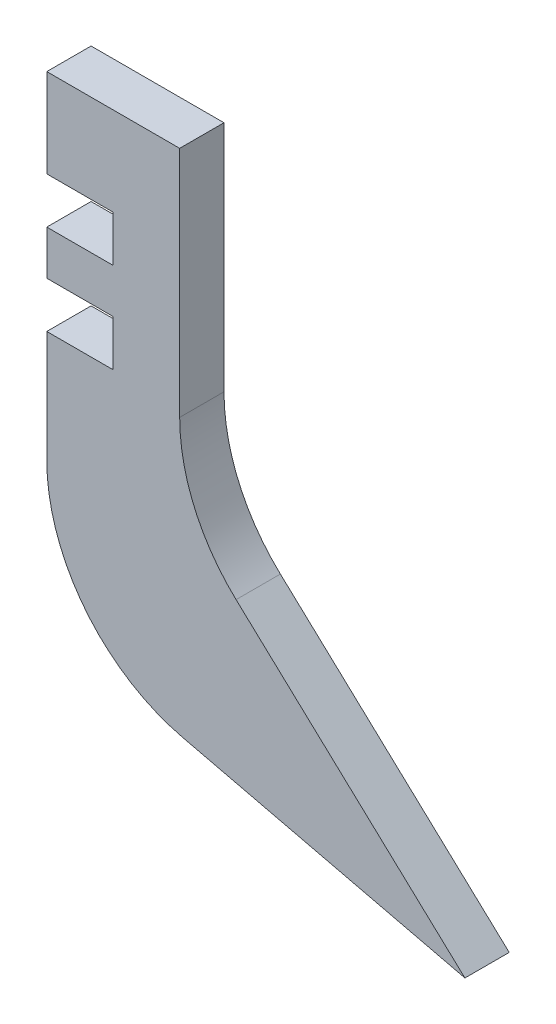
ISO-10303-21;
HEADER;
FILE_DESCRIPTION(('STEP AP214'),'2;1');
FILE_NAME('part.step','',(''),(''),'','','');
FILE_SCHEMA(('AUTOMOTIVE_DESIGN { 1 0 10303 214 1 1 1 1 }'));
ENDSEC;
DATA;
#1=APPLICATION_CONTEXT('core data for automotive mechanical design processes');
#2=APPLICATION_PROTOCOL_DEFINITION('international standard','automotive_design',2000,#1);
#3=PRODUCT_CONTEXT('',#1,'mechanical');
#4=PRODUCT('Part','Part','',(#3));
#5=PRODUCT_RELATED_PRODUCT_CATEGORY('part','',(#4));
#6=PRODUCT_DEFINITION_FORMATION('','',#4);
#7=PRODUCT_DEFINITION_CONTEXT('part definition',#1,'design');
#8=PRODUCT_DEFINITION('design','',#6,#7);
#9=PRODUCT_DEFINITION_SHAPE('','',#8);
#10=(LENGTH_UNIT() NAMED_UNIT(*) SI_UNIT(.MILLI.,.METRE.));
#11=(NAMED_UNIT(*) PLANE_ANGLE_UNIT() SI_UNIT($,.RADIAN.));
#12=(NAMED_UNIT(*) SI_UNIT($,.STERADIAN.) SOLID_ANGLE_UNIT());
#13=UNCERTAINTY_MEASURE_WITH_UNIT(LENGTH_MEASURE(1.E-05),#10,'distance_accuracy_value','');
#14=(GEOMETRIC_REPRESENTATION_CONTEXT(3) GLOBAL_UNCERTAINTY_ASSIGNED_CONTEXT((#13)) GLOBAL_UNIT_ASSIGNED_CONTEXT((#10,
#11,#12)) REPRESENTATION_CONTEXT('',''));
#15=CARTESIAN_POINT('',(0.,0.,0.));
#16=DIRECTION('',(0.,0.,1.));
#17=DIRECTION('',(1.,0.,0.));
#18=AXIS2_PLACEMENT_3D('',#15,#16,#17);
#19=CARTESIAN_POINT('',(0.,53.7638830171852,5.));
#20=DIRECTION('',(1.,0.,0.));
#21=DIRECTION('',(0.,0.,-1.));
#22=AXIS2_PLACEMENT_3D('',#19,#20,#21);
#23=PLANE('',#22);
#24=DIRECTION('',(0.,0.,-1.));
#25=VECTOR('',#24,1.);
#26=CARTESIAN_POINT('',(0.,28.3638830171852,5.));
#27=LINE('',#26,#25);
#28=CARTESIAN_POINT('',(0.,28.3638830171852,5.));
#29=VERTEX_POINT('',#28);
#30=CARTESIAN_POINT('',(0.,28.3638830171852,0.));
#31=VERTEX_POINT('',#30);
#32=EDGE_CURVE('E140',#29,#31,#27,.T.);
#33=ORIENTED_EDGE('',*,*,#32,.T.);
#34=DIRECTION('',(0.,-1.,0.));
#35=VECTOR('',#34,1.);
#36=CARTESIAN_POINT('',(0.,53.7638830171852,0.));
#37=LINE('',#36,#35);
#38=CARTESIAN_POINT('',(0.,15.7972957955316,0.));
#39=VERTEX_POINT('',#38);
#40=EDGE_CURVE('E189',#31,#39,#37,.T.);
#41=ORIENTED_EDGE('',*,*,#40,.T.);
#42=DIRECTION('',(0.,0.,-1.));
#43=VECTOR('',#42,1.);
#44=CARTESIAN_POINT('',(0.,15.7972957955316,5.));
#45=LINE('',#44,#43);
#46=CARTESIAN_POINT('',(0.,15.7972957955316,5.));
#47=VERTEX_POINT('',#46);
#48=EDGE_CURVE('E163',#39,#47,#45,.F.);
#49=ORIENTED_EDGE('',*,*,#48,.T.);
#50=DIRECTION('',(0.,-1.,0.));
#51=VECTOR('',#50,1.);
#52=CARTESIAN_POINT('',(0.,53.7638830171852,5.));
#53=LINE('',#52,#51);
#54=EDGE_CURVE('E156',#29,#47,#53,.T.);
#55=ORIENTED_EDGE('',*,*,#54,.F.);
#56=EDGE_LOOP('',(#33,#41,#49,#55));
#57=FACE_BOUND('',#56,.T.);
#58=ADVANCED_FACE('F33',(#57),#23,.F.);
#59=DIRECTION('',(0.,0.,-1.));
#60=VECTOR('',#59,1.);
#61=CARTESIAN_POINT('',(0.,33.5638830171852,5.));
#62=LINE('',#61,#60);
#63=CARTESIAN_POINT('',(0.,33.5638830171852,5.));
#64=VERTEX_POINT('',#63);
#65=CARTESIAN_POINT('',(0.,33.5638830171852,0.));
#66=VERTEX_POINT('',#65);
#67=EDGE_CURVE('E48',#64,#66,#62,.T.);
#68=ORIENTED_EDGE('',*,*,#67,.F.);
#69=CARTESIAN_POINT('',(0.,38.5638830171852,5.));
#70=VERTEX_POINT('',#69);
#71=EDGE_CURVE('E165',#70,#64,#53,.T.);
#72=ORIENTED_EDGE('',*,*,#71,.F.);
#73=DIRECTION('',(0.,0.,-1.));
#74=VECTOR('',#73,1.);
#75=CARTESIAN_POINT('',(0.,38.5638830171852,5.));
#76=LINE('',#75,#74);
#77=CARTESIAN_POINT('',(0.,38.5638830171852,0.));
#78=VERTEX_POINT('',#77);
#79=EDGE_CURVE('E190',#70,#78,#76,.T.);
#80=ORIENTED_EDGE('',*,*,#79,.T.);
#81=EDGE_CURVE('E195',#78,#66,#37,.T.);
#82=ORIENTED_EDGE('',*,*,#81,.T.);
#83=EDGE_LOOP('',(#68,#72,#80,#82));
#84=FACE_BOUND('',#83,.T.);
#85=ADVANCED_FACE('F262',(#84),#23,.F.);
#86=CARTESIAN_POINT('',(0.,0.,5.));
#87=DIRECTION('',(0.,0.,-1.));
#88=DIRECTION('',(-1.,0.,0.));
#89=AXIS2_PLACEMENT_3D('',#86,#87,#88);
#90=PLANE('',#89);
#91=DIRECTION('',(1.,0.,0.));
#92=VECTOR('',#91,1.);
#93=CARTESIAN_POINT('',(0.,28.3638830171852,5.));
#94=LINE('',#93,#92);
#95=CARTESIAN_POINT('',(7.5,28.3638830171852,5.));
#96=VERTEX_POINT('',#95);
#97=EDGE_CURVE('E143',#29,#96,#94,.T.);
#98=ORIENTED_EDGE('',*,*,#97,.F.);
#99=ORIENTED_EDGE('',*,*,#54,.T.);
#100=CARTESIAN_POINT('',(20.,15.7972957955316,5.));
#101=DIRECTION('',(0.,0.,-1.));
#102=DIRECTION('',(-1.,0.,0.));
#103=AXIS2_PLACEMENT_3D('',#100,#101,#102);
#104=CIRCLE('',#103,20.);
#105=CARTESIAN_POINT('',(15.3677348725385,-3.65886312109178,5.));
#106=VERTEX_POINT('',#105);
#107=EDGE_CURVE('E216',#47,#106,#104,.F.);
#108=ORIENTED_EDGE('',*,*,#107,.T.);
#109=DIRECTION('',(0.972807945831169,-0.231613256373076,0.));
#110=VECTOR('',#109,1.);
#111=CARTESIAN_POINT('',(0.,0.,5.));
#112=LINE('',#111,#110);
#113=CARTESIAN_POINT('',(47.1932567778595,-11.2361169828148,5.));
#114=VERTEX_POINT('',#113);
#115=EDGE_CURVE('E175',#106,#114,#112,.T.);
#116=ORIENTED_EDGE('',*,*,#115,.T.);
#117=DIRECTION('',(-0.731588261023589,0.68174673914327,0.));
#118=VECTOR('',#117,1.);
#119=CARTESIAN_POINT('',(15.,18.7638830171852,5.));
#120=LINE('',#119,#118);
#121=CARTESIAN_POINT('',(21.3650652171346,12.8324558915716,5.));
#122=VERTEX_POINT('',#121);
#123=EDGE_CURVE('E177',#114,#122,#120,.T.);
#124=ORIENTED_EDGE('',*,*,#123,.T.);
#125=CARTESIAN_POINT('',(35.,27.4642211120434,5.));
#126=DIRECTION('',(0.,0.,-1.));
#127=DIRECTION('',(-1.,0.,0.));
#128=AXIS2_PLACEMENT_3D('',#125,#126,#127);
#129=CIRCLE('',#128,20.);
#130=CARTESIAN_POINT('',(15.,27.4642211120434,5.));
#131=VERTEX_POINT('',#130);
#132=EDGE_CURVE('E11',#122,#131,#129,.T.);
#133=ORIENTED_EDGE('',*,*,#132,.T.);
#134=DIRECTION('',(0.,1.,0.));
#135=VECTOR('',#134,1.);
#136=CARTESIAN_POINT('',(15.,53.7638830171852,5.));
#137=LINE('',#136,#135);
#138=CARTESIAN_POINT('',(15.,53.7638830171852,5.));
#139=VERTEX_POINT('',#138);
#140=EDGE_CURVE('E181',#131,#139,#137,.T.);
#141=ORIENTED_EDGE('',*,*,#140,.T.);
#142=DIRECTION('',(-1.,0.,0.));
#143=VECTOR('',#142,1.);
#144=CARTESIAN_POINT('',(0.,53.7638830171852,5.));
#145=LINE('',#144,#143);
#146=CARTESIAN_POINT('',(0.,53.7638830171852,5.));
#147=VERTEX_POINT('',#146);
#148=EDGE_CURVE('E166',#139,#147,#145,.T.);
#149=ORIENTED_EDGE('',*,*,#148,.T.);
#150=CARTESIAN_POINT('',(0.,43.7638830171852,5.));
#151=VERTEX_POINT('',#150);
#152=EDGE_CURVE('E168',#147,#151,#53,.T.);
#153=ORIENTED_EDGE('',*,*,#152,.T.);
#154=DIRECTION('',(-1.,0.,0.));
#155=VECTOR('',#154,1.);
#156=CARTESIAN_POINT('',(0.,43.7638830171852,5.));
#157=LINE('',#156,#155);
#158=CARTESIAN_POINT('',(7.5,43.7638830171852,5.));
#159=VERTEX_POINT('',#158);
#160=EDGE_CURVE('E246',#159,#151,#157,.T.);
#161=ORIENTED_EDGE('',*,*,#160,.F.);
#162=DIRECTION('',(0.,1.,0.));
#163=VECTOR('',#162,1.);
#164=CARTESIAN_POINT('',(7.5,43.7638830171852,5.));
#165=LINE('',#164,#163);
#166=CARTESIAN_POINT('',(7.5,38.5638830171852,5.));
#167=VERTEX_POINT('',#166);
#168=EDGE_CURVE('E250',#167,#159,#165,.T.);
#169=ORIENTED_EDGE('',*,*,#168,.F.);
#170=DIRECTION('',(1.,0.,0.));
#171=VECTOR('',#170,1.);
#172=CARTESIAN_POINT('',(0.,38.5638830171852,5.));
#173=LINE('',#172,#171);
#174=EDGE_CURVE('E341',#70,#167,#173,.T.);
#175=ORIENTED_EDGE('',*,*,#174,.F.);
#176=ORIENTED_EDGE('',*,*,#71,.T.);
#177=DIRECTION('',(-1.,0.,0.));
#178=VECTOR('',#177,1.);
#179=CARTESIAN_POINT('',(0.,33.5638830171852,5.));
#180=LINE('',#179,#178);
#181=CARTESIAN_POINT('',(7.5,33.5638830171852,5.));
#182=VERTEX_POINT('',#181);
#183=EDGE_CURVE('E338',#182,#64,#180,.T.);
#184=ORIENTED_EDGE('',*,*,#183,.F.);
#185=DIRECTION('',(0.,1.,0.));
#186=VECTOR('',#185,1.);
#187=CARTESIAN_POINT('',(7.5,33.5638830171852,5.));
#188=LINE('',#187,#186);
#189=EDGE_CURVE('E159',#96,#182,#188,.T.);
#190=ORIENTED_EDGE('',*,*,#189,.F.);
#191=EDGE_LOOP('',(#98,#99,#108,#116,#124,#133,#141,#149,#153,#161,#169,#175,#176,#184,#190));
#192=FACE_BOUND('',#191,.T.);
#193=ADVANCED_FACE('F155',(#192),#90,.F.);
#194=CARTESIAN_POINT('',(0.,0.,0.));
#195=DIRECTION('',(0.,0.,-1.));
#196=DIRECTION('',(-1.,0.,0.));
#197=AXIS2_PLACEMENT_3D('',#194,#195,#196);
#198=PLANE('',#197);
#199=ORIENTED_EDGE('',*,*,#40,.F.);
#200=DIRECTION('',(1.,0.,0.));
#201=VECTOR('',#200,1.);
#202=CARTESIAN_POINT('',(0.,28.3638830171852,0.));
#203=LINE('',#202,#201);
#204=CARTESIAN_POINT('',(7.5,28.3638830171852,0.));
#205=VERTEX_POINT('',#204);
#206=EDGE_CURVE('E146',#31,#205,#203,.T.);
#207=ORIENTED_EDGE('',*,*,#206,.T.);
#208=DIRECTION('',(0.,1.,0.));
#209=VECTOR('',#208,1.);
#210=CARTESIAN_POINT('',(7.5,33.5638830171852,0.));
#211=LINE('',#210,#209);
#212=CARTESIAN_POINT('',(7.5,33.5638830171852,0.));
#213=VERTEX_POINT('',#212);
#214=EDGE_CURVE('E330',#205,#213,#211,.T.);
#215=ORIENTED_EDGE('',*,*,#214,.T.);
#216=DIRECTION('',(-1.,0.,0.));
#217=VECTOR('',#216,1.);
#218=CARTESIAN_POINT('',(0.,33.5638830171852,0.));
#219=LINE('',#218,#217);
#220=EDGE_CURVE('E160',#213,#66,#219,.T.);
#221=ORIENTED_EDGE('',*,*,#220,.T.);
#222=ORIENTED_EDGE('',*,*,#81,.F.);
#223=DIRECTION('',(1.,0.,0.));
#224=VECTOR('',#223,1.);
#225=CARTESIAN_POINT('',(0.,38.5638830171852,0.));
#226=LINE('',#225,#224);
#227=CARTESIAN_POINT('',(7.5,38.5638830171852,0.));
#228=VERTEX_POINT('',#227);
#229=EDGE_CURVE('E150',#78,#228,#226,.T.);
#230=ORIENTED_EDGE('',*,*,#229,.T.);
#231=DIRECTION('',(0.,1.,0.));
#232=VECTOR('',#231,1.);
#233=CARTESIAN_POINT('',(7.5,43.7638830171852,0.));
#234=LINE('',#233,#232);
#235=CARTESIAN_POINT('',(7.5,43.7638830171852,0.));
#236=VERTEX_POINT('',#235);
#237=EDGE_CURVE('E344',#228,#236,#234,.T.);
#238=ORIENTED_EDGE('',*,*,#237,.T.);
#239=DIRECTION('',(-1.,0.,0.));
#240=VECTOR('',#239,1.);
#241=CARTESIAN_POINT('',(0.,43.7638830171852,0.));
#242=LINE('',#241,#240);
#243=CARTESIAN_POINT('',(0.,43.7638830171852,0.));
#244=VERTEX_POINT('',#243);
#245=EDGE_CURVE('E253',#236,#244,#242,.T.);
#246=ORIENTED_EDGE('',*,*,#245,.T.);
#247=CARTESIAN_POINT('',(0.,53.7638830171852,0.));
#248=VERTEX_POINT('',#247);
#249=EDGE_CURVE('E191',#248,#244,#37,.T.);
#250=ORIENTED_EDGE('',*,*,#249,.F.);
#251=DIRECTION('',(-1.,0.,0.));
#252=VECTOR('',#251,1.);
#253=CARTESIAN_POINT('',(0.,53.7638830171852,0.));
#254=LINE('',#253,#252);
#255=CARTESIAN_POINT('',(15.,53.7638830171852,0.));
#256=VERTEX_POINT('',#255);
#257=EDGE_CURVE('E186',#256,#248,#254,.T.);
#258=ORIENTED_EDGE('',*,*,#257,.F.);
#259=DIRECTION('',(0.,1.,0.));
#260=VECTOR('',#259,1.);
#261=CARTESIAN_POINT('',(15.,53.7638830171852,0.));
#262=LINE('',#261,#260);
#263=CARTESIAN_POINT('',(15.,27.4642211120434,0.));
#264=VERTEX_POINT('',#263);
#265=EDGE_CURVE('E171',#264,#256,#262,.T.);
#266=ORIENTED_EDGE('',*,*,#265,.F.);
#267=CARTESIAN_POINT('',(35.,27.4642211120434,0.));
#268=DIRECTION('',(0.,0.,-1.));
#269=DIRECTION('',(-1.,0.,0.));
#270=AXIS2_PLACEMENT_3D('',#267,#268,#269);
#271=CIRCLE('',#270,20.);
#272=CARTESIAN_POINT('',(21.3650652171346,12.8324558915716,0.));
#273=VERTEX_POINT('',#272);
#274=EDGE_CURVE('E41',#264,#273,#271,.F.);
#275=ORIENTED_EDGE('',*,*,#274,.T.);
#276=DIRECTION('',(-0.731588261023589,0.68174673914327,0.));
#277=VECTOR('',#276,1.);
#278=CARTESIAN_POINT('',(15.,18.7638830171852,0.));
#279=LINE('',#278,#277);
#280=CARTESIAN_POINT('',(47.1932567778595,-11.2361169828148,0.));
#281=VERTEX_POINT('',#280);
#282=EDGE_CURVE('E197',#281,#273,#279,.T.);
#283=ORIENTED_EDGE('',*,*,#282,.F.);
#284=DIRECTION('',(0.972807945831169,-0.231613256373076,0.));
#285=VECTOR('',#284,1.);
#286=CARTESIAN_POINT('',(0.,0.,0.));
#287=LINE('',#286,#285);
#288=CARTESIAN_POINT('',(15.3677348725385,-3.65886312109178,0.));
#289=VERTEX_POINT('',#288);
#290=EDGE_CURVE('E194',#289,#281,#287,.T.);
#291=ORIENTED_EDGE('',*,*,#290,.F.);
#292=CARTESIAN_POINT('',(20.,15.7972957955316,0.));
#293=DIRECTION('',(0.,0.,-1.));
#294=DIRECTION('',(-1.,0.,0.));
#295=AXIS2_PLACEMENT_3D('',#292,#293,#294);
#296=CIRCLE('',#295,20.);
#297=EDGE_CURVE('E212',#289,#39,#296,.T.);
#298=ORIENTED_EDGE('',*,*,#297,.T.);
#299=EDGE_LOOP('',(#199,#207,#215,#221,#222,#230,#238,#246,#250,#258,#266,#275,#283,#291,#298));
#300=FACE_BOUND('',#299,.T.);
#301=ADVANCED_FACE('F225',(#300),#198,.T.);
#302=DIRECTION('',(0.,0.,-1.));
#303=VECTOR('',#302,1.);
#304=CARTESIAN_POINT('',(0.,43.7638830171852,5.));
#305=LINE('',#304,#303);
#306=EDGE_CURVE('E56',#151,#244,#305,.T.);
#307=ORIENTED_EDGE('',*,*,#306,.F.);
#308=ORIENTED_EDGE('',*,*,#152,.F.);
#309=DIRECTION('',(0.,0.,-1.));
#310=VECTOR('',#309,1.);
#311=CARTESIAN_POINT('',(0.,53.7638830171852,5.));
#312=LINE('',#311,#310);
#313=EDGE_CURVE('E206',#147,#248,#312,.T.);
#314=ORIENTED_EDGE('',*,*,#313,.T.);
#315=ORIENTED_EDGE('',*,*,#249,.T.);
#316=EDGE_LOOP('',(#307,#308,#314,#315));
#317=FACE_BOUND('',#316,.T.);
#318=ADVANCED_FACE('F244',(#317),#23,.F.);
#319=CARTESIAN_POINT('',(0.,53.7638830171852,5.));
#320=DIRECTION('',(0.,-1.,0.));
#321=DIRECTION('',(0.,0.,-1.));
#322=AXIS2_PLACEMENT_3D('',#319,#320,#321);
#323=PLANE('',#322);
#324=ORIENTED_EDGE('',*,*,#257,.T.);
#325=ORIENTED_EDGE('',*,*,#313,.F.);
#326=ORIENTED_EDGE('',*,*,#148,.F.);
#327=DIRECTION('',(0.,0.,-1.));
#328=VECTOR('',#327,1.);
#329=CARTESIAN_POINT('',(15.,53.7638830171852,5.));
#330=LINE('',#329,#328);
#331=EDGE_CURVE('E185',#139,#256,#330,.T.);
#332=ORIENTED_EDGE('',*,*,#331,.T.);
#333=EDGE_LOOP('',(#324,#325,#326,#332));
#334=FACE_BOUND('',#333,.T.);
#335=ADVANCED_FACE('F242',(#334),#323,.F.);
#336=CARTESIAN_POINT('',(0.,0.,5.));
#337=DIRECTION('',(0.231613256373076,0.972807945831169,0.));
#338=DIRECTION('',(-0.97280794583117,0.231613256373076,0.));
#339=AXIS2_PLACEMENT_3D('',#336,#337,#338);
#340=PLANE('',#339);
#341=ORIENTED_EDGE('',*,*,#115,.F.);
#342=DIRECTION('',(0.,0.,-1.));
#343=VECTOR('',#342,1.);
#344=CARTESIAN_POINT('',(15.3677348725385,-3.65886312109178,5.));
#345=LINE('',#344,#343);
#346=EDGE_CURVE('E209',#106,#289,#345,.T.);
#347=ORIENTED_EDGE('',*,*,#346,.T.);
#348=ORIENTED_EDGE('',*,*,#290,.T.);
#349=DIRECTION('',(0.,0.,-1.));
#350=VECTOR('',#349,1.);
#351=CARTESIAN_POINT('',(47.1932567778595,-11.2361169828148,5.));
#352=LINE('',#351,#350);
#353=EDGE_CURVE('E203',#114,#281,#352,.T.);
#354=ORIENTED_EDGE('',*,*,#353,.F.);
#355=EDGE_LOOP('',(#341,#347,#348,#354));
#356=FACE_BOUND('',#355,.T.);
#357=ADVANCED_FACE('F272',(#356),#340,.F.);
#358=CARTESIAN_POINT('',(15.,18.7638830171852,5.));
#359=DIRECTION('',(-0.68174673914327,-0.731588261023589,0.));
#360=DIRECTION('',(0.731588261023589,-0.68174673914327,0.));
#361=AXIS2_PLACEMENT_3D('',#358,#359,#360);
#362=PLANE('',#361);
#363=ORIENTED_EDGE('',*,*,#282,.T.);
#364=DIRECTION('',(0.,0.,-1.));
#365=VECTOR('',#364,1.);
#366=CARTESIAN_POINT('',(21.3650652171346,12.8324558915716,5.));
#367=LINE('',#366,#365);
#368=EDGE_CURVE('E221',#273,#122,#367,.F.);
#369=ORIENTED_EDGE('',*,*,#368,.T.);
#370=ORIENTED_EDGE('',*,*,#123,.F.);
#371=ORIENTED_EDGE('',*,*,#353,.T.);
#372=EDGE_LOOP('',(#363,#369,#370,#371));
#373=FACE_BOUND('',#372,.T.);
#374=ADVANCED_FACE('F232',(#373),#362,.F.);
#375=CARTESIAN_POINT('',(15.,53.7638830171852,5.));
#376=DIRECTION('',(-1.,0.,0.));
#377=DIRECTION('',(0.,0.,1.));
#378=AXIS2_PLACEMENT_3D('',#375,#376,#377);
#379=PLANE('',#378);
#380=ORIENTED_EDGE('',*,*,#140,.F.);
#381=DIRECTION('',(0.,0.,-1.));
#382=VECTOR('',#381,1.);
#383=CARTESIAN_POINT('',(15.,27.4642211120434,0.));
#384=LINE('',#383,#382);
#385=EDGE_CURVE('E218',#131,#264,#384,.T.);
#386=ORIENTED_EDGE('',*,*,#385,.T.);
#387=ORIENTED_EDGE('',*,*,#265,.T.);
#388=ORIENTED_EDGE('',*,*,#331,.F.);
#389=EDGE_LOOP('',(#380,#386,#387,#388));
#390=FACE_BOUND('',#389,.T.);
#391=ADVANCED_FACE('F238',(#390),#379,.F.);
#392=CARTESIAN_POINT('',(20.,15.7972957955316,5.));
#393=DIRECTION('',(0.,0.,-1.));
#394=DIRECTION('',(-1.,0.,0.));
#395=AXIS2_PLACEMENT_3D('',#392,#393,#394);
#396=CYLINDRICAL_SURFACE('',#395,20.);
#397=ORIENTED_EDGE('',*,*,#107,.F.);
#398=ORIENTED_EDGE('',*,*,#48,.F.);
#399=ORIENTED_EDGE('',*,*,#297,.F.);
#400=ORIENTED_EDGE('',*,*,#346,.F.);
#401=EDGE_LOOP('',(#397,#398,#399,#400));
#402=FACE_BOUND('',#401,.T.);
#403=ADVANCED_FACE('F270',(#402),#396,.T.);
#404=CARTESIAN_POINT('',(35.,27.4642211120434,5.));
#405=DIRECTION('',(0.,0.,1.));
#406=DIRECTION('',(1.,0.,0.));
#407=AXIS2_PLACEMENT_3D('',#404,#405,#406);
#408=CYLINDRICAL_SURFACE('',#407,20.);
#409=ORIENTED_EDGE('',*,*,#132,.F.);
#410=ORIENTED_EDGE('',*,*,#368,.F.);
#411=ORIENTED_EDGE('',*,*,#274,.F.);
#412=ORIENTED_EDGE('',*,*,#385,.F.);
#413=EDGE_LOOP('',(#409,#410,#411,#412));
#414=FACE_BOUND('',#413,.T.);
#415=ADVANCED_FACE('F35',(#414),#408,.F.);
#416=CARTESIAN_POINT('',(0.,38.5638830171852,5.));
#417=DIRECTION('',(0.,1.,0.));
#418=DIRECTION('',(0.,0.,1.));
#419=AXIS2_PLACEMENT_3D('',#416,#417,#418);
#420=PLANE('',#419);
#421=ORIENTED_EDGE('',*,*,#229,.F.);
#422=ORIENTED_EDGE('',*,*,#79,.F.);
#423=ORIENTED_EDGE('',*,*,#174,.T.);
#424=DIRECTION('',(0.,0.,-1.));
#425=VECTOR('',#424,1.);
#426=CARTESIAN_POINT('',(7.5,38.5638830171852,5.));
#427=LINE('',#426,#425);
#428=EDGE_CURVE('E248',#167,#228,#427,.T.);
#429=ORIENTED_EDGE('',*,*,#428,.T.);
#430=EDGE_LOOP('',(#421,#422,#423,#429));
#431=FACE_BOUND('',#430,.T.);
#432=ADVANCED_FACE('F304',(#431),#420,.T.);
#433=CARTESIAN_POINT('',(7.5,43.7638830171852,5.));
#434=DIRECTION('',(-1.,0.,0.));
#435=DIRECTION('',(0.,-1.,0.));
#436=AXIS2_PLACEMENT_3D('',#433,#434,#435);
#437=PLANE('',#436);
#438=ORIENTED_EDGE('',*,*,#237,.F.);
#439=ORIENTED_EDGE('',*,*,#428,.F.);
#440=ORIENTED_EDGE('',*,*,#168,.T.);
#441=DIRECTION('',(0.,0.,-1.));
#442=VECTOR('',#441,1.);
#443=CARTESIAN_POINT('',(7.5,43.7638830171852,5.));
#444=LINE('',#443,#442);
#445=EDGE_CURVE('E245',#159,#236,#444,.T.);
#446=ORIENTED_EDGE('',*,*,#445,.T.);
#447=EDGE_LOOP('',(#438,#439,#440,#446));
#448=FACE_BOUND('',#447,.T.);
#449=ADVANCED_FACE('F308',(#448),#437,.T.);
#450=CARTESIAN_POINT('',(0.,43.7638830171852,5.));
#451=DIRECTION('',(0.,-1.,0.));
#452=DIRECTION('',(0.,0.,-1.));
#453=AXIS2_PLACEMENT_3D('',#450,#451,#452);
#454=PLANE('',#453);
#455=ORIENTED_EDGE('',*,*,#245,.F.);
#456=ORIENTED_EDGE('',*,*,#445,.F.);
#457=ORIENTED_EDGE('',*,*,#160,.T.);
#458=ORIENTED_EDGE('',*,*,#306,.T.);
#459=EDGE_LOOP('',(#455,#456,#457,#458));
#460=FACE_BOUND('',#459,.T.);
#461=ADVANCED_FACE('F312',(#460),#454,.T.);
#462=CARTESIAN_POINT('',(0.,28.3638830171852,5.));
#463=DIRECTION('',(0.,1.,0.));
#464=DIRECTION('',(0.,0.,1.));
#465=AXIS2_PLACEMENT_3D('',#462,#463,#464);
#466=PLANE('',#465);
#467=ORIENTED_EDGE('',*,*,#206,.F.);
#468=ORIENTED_EDGE('',*,*,#32,.F.);
#469=ORIENTED_EDGE('',*,*,#97,.T.);
#470=DIRECTION('',(0.,0.,-1.));
#471=VECTOR('',#470,1.);
#472=CARTESIAN_POINT('',(7.5,28.3638830171852,5.));
#473=LINE('',#472,#471);
#474=EDGE_CURVE('E151',#96,#205,#473,.T.);
#475=ORIENTED_EDGE('',*,*,#474,.T.);
#476=EDGE_LOOP('',(#467,#468,#469,#475));
#477=FACE_BOUND('',#476,.T.);
#478=ADVANCED_FACE('F142',(#477),#466,.T.);
#479=CARTESIAN_POINT('',(7.5,33.5638830171852,5.));
#480=DIRECTION('',(-1.,0.,0.));
#481=DIRECTION('',(0.,0.,1.));
#482=AXIS2_PLACEMENT_3D('',#479,#480,#481);
#483=PLANE('',#482);
#484=ORIENTED_EDGE('',*,*,#214,.F.);
#485=ORIENTED_EDGE('',*,*,#474,.F.);
#486=ORIENTED_EDGE('',*,*,#189,.T.);
#487=DIRECTION('',(0.,0.,-1.));
#488=VECTOR('',#487,1.);
#489=CARTESIAN_POINT('',(7.5,33.5638830171852,5.));
#490=LINE('',#489,#488);
#491=EDGE_CURVE('E329',#182,#213,#490,.T.);
#492=ORIENTED_EDGE('',*,*,#491,.T.);
#493=EDGE_LOOP('',(#484,#485,#486,#492));
#494=FACE_BOUND('',#493,.T.);
#495=ADVANCED_FACE('F320',(#494),#483,.T.);
#496=CARTESIAN_POINT('',(0.,33.5638830171852,5.));
#497=DIRECTION('',(0.,-1.,0.));
#498=DIRECTION('',(0.,0.,-1.));
#499=AXIS2_PLACEMENT_3D('',#496,#497,#498);
#500=PLANE('',#499);
#501=ORIENTED_EDGE('',*,*,#220,.F.);
#502=ORIENTED_EDGE('',*,*,#491,.F.);
#503=ORIENTED_EDGE('',*,*,#183,.T.);
#504=ORIENTED_EDGE('',*,*,#67,.T.);
#505=EDGE_LOOP('',(#501,#502,#503,#504));
#506=FACE_BOUND('',#505,.T.);
#507=ADVANCED_FACE('F323',(#506),#500,.T.);
#508=CLOSED_SHELL('',(#58,#85,#193,#301,#318,#335,#357,#374,#391,#403,#415,#432,#449,#461,#478,
#495,#507));
#509=MANIFOLD_SOLID_BREP('B2',#508);
#510=ADVANCED_BREP_SHAPE_REPRESENTATION('',(#18,#509),#14);
#511=SHAPE_DEFINITION_REPRESENTATION(#9,#510);
ENDSEC;
END-ISO-10303-21;
